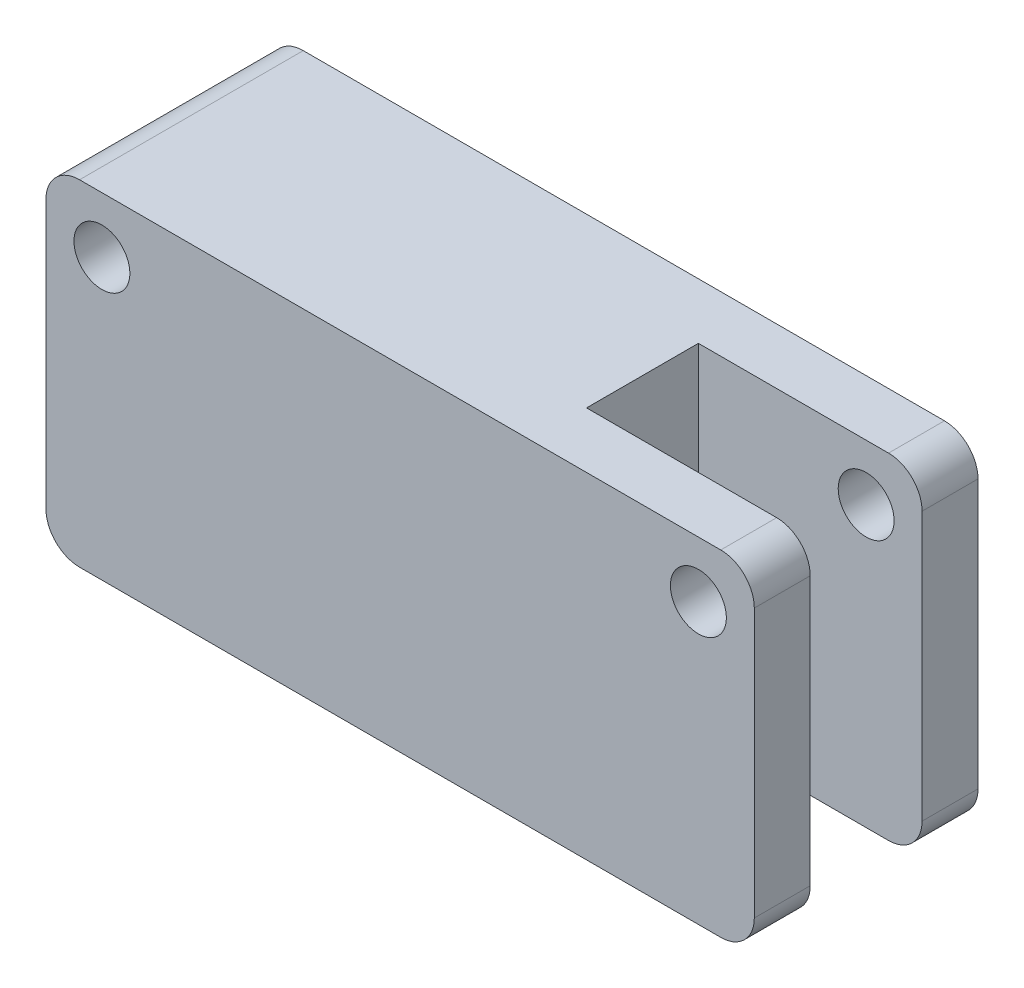
ISO-10303-21;
HEADER;
FILE_DESCRIPTION(('STEP AP214'),'2;1');
FILE_NAME('part.step','',(''),(''),'','','');
FILE_SCHEMA(('AUTOMOTIVE_DESIGN { 1 0 10303 214 1 1 1 1 }'));
ENDSEC;
DATA;
#1=APPLICATION_CONTEXT('core data for automotive mechanical design processes');
#2=APPLICATION_PROTOCOL_DEFINITION('international standard','automotive_design',2000,#1);
#3=PRODUCT_CONTEXT('',#1,'mechanical');
#4=PRODUCT('Part','Part','',(#3));
#5=PRODUCT_RELATED_PRODUCT_CATEGORY('part','',(#4));
#6=PRODUCT_DEFINITION_FORMATION('','',#4);
#7=PRODUCT_DEFINITION_CONTEXT('part definition',#1,'design');
#8=PRODUCT_DEFINITION('design','',#6,#7);
#9=PRODUCT_DEFINITION_SHAPE('','',#8);
#10=(LENGTH_UNIT() NAMED_UNIT(*) SI_UNIT(.MILLI.,.METRE.));
#11=(NAMED_UNIT(*) PLANE_ANGLE_UNIT() SI_UNIT($,.RADIAN.));
#12=(NAMED_UNIT(*) SI_UNIT($,.STERADIAN.) SOLID_ANGLE_UNIT());
#13=UNCERTAINTY_MEASURE_WITH_UNIT(LENGTH_MEASURE(1.E-05),#10,'distance_accuracy_value','');
#14=(GEOMETRIC_REPRESENTATION_CONTEXT(3) GLOBAL_UNCERTAINTY_ASSIGNED_CONTEXT((#13)) GLOBAL_UNIT_ASSIGNED_CONTEXT((#10,
#11,#12)) REPRESENTATION_CONTEXT('',''));
#15=CARTESIAN_POINT('',(0.,0.,0.));
#16=DIRECTION('',(0.,0.,1.));
#17=DIRECTION('',(1.,0.,0.));
#18=AXIS2_PLACEMENT_3D('',#15,#16,#17);
#19=CARTESIAN_POINT('',(63.33,15.,10.));
#20=DIRECTION('',(-1.,0.,0.));
#21=DIRECTION('',(0.,0.,1.));
#22=AXIS2_PLACEMENT_3D('',#19,#20,#21);
#23=PLANE('',#22);
#24=DIRECTION('',(0.,0.,-1.));
#25=VECTOR('',#24,1.);
#26=CARTESIAN_POINT('',(63.33,12.,10.));
#27=LINE('',#26,#25);
#28=CARTESIAN_POINT('',(63.33,12.,-10.));
#29=VERTEX_POINT('',#28);
#30=CARTESIAN_POINT('',(63.33,12.,-5.));
#31=VERTEX_POINT('',#30);
#32=EDGE_CURVE('E226',#29,#31,#27,.F.);
#33=ORIENTED_EDGE('',*,*,#32,.T.);
#34=DIRECTION('',(0.,1.,0.));
#35=VECTOR('',#34,1.);
#36=CARTESIAN_POINT('',(63.33,-15.,-5.));
#37=LINE('',#36,#35);
#38=CARTESIAN_POINT('',(63.33,-12.,-5.));
#39=VERTEX_POINT('',#38);
#40=EDGE_CURVE('E174',#39,#31,#37,.T.);
#41=ORIENTED_EDGE('',*,*,#40,.F.);
#42=DIRECTION('',(0.,0.,-1.));
#43=VECTOR('',#42,1.);
#44=CARTESIAN_POINT('',(63.33,-12.,-10.));
#45=LINE('',#44,#43);
#46=CARTESIAN_POINT('',(63.33,-12.,-10.));
#47=VERTEX_POINT('',#46);
#48=EDGE_CURVE('E221',#39,#47,#45,.T.);
#49=ORIENTED_EDGE('',*,*,#48,.T.);
#50=DIRECTION('',(0.,-1.,0.));
#51=VECTOR('',#50,1.);
#52=CARTESIAN_POINT('',(63.33,15.,-10.));
#53=LINE('',#52,#51);
#54=EDGE_CURVE('E197',#29,#47,#53,.T.);
#55=ORIENTED_EDGE('',*,*,#54,.F.);
#56=EDGE_LOOP('',(#33,#41,#49,#55));
#57=FACE_BOUND('',#56,.T.);
#58=ADVANCED_FACE('F36',(#57),#23,.F.);
#59=CARTESIAN_POINT('',(60.33,12.,0.));
#60=DIRECTION('',(0.,0.,-1.));
#61=DIRECTION('',(-1.,0.,0.));
#62=AXIS2_PLACEMENT_3D('',#59,#60,#61);
#63=CYLINDRICAL_SURFACE('',#62,3.);
#64=CARTESIAN_POINT('',(60.33,12.,-5.));
#65=DIRECTION('',(0.,0.,-1.));
#66=DIRECTION('',(-1.,0.,0.));
#67=AXIS2_PLACEMENT_3D('',#64,#65,#66);
#68=CIRCLE('',#67,3.);
#69=CARTESIAN_POINT('',(60.33,15.,-5.));
#70=VERTEX_POINT('',#69);
#71=EDGE_CURVE('E180',#31,#70,#68,.F.);
#72=ORIENTED_EDGE('',*,*,#71,.F.);
#73=ORIENTED_EDGE('',*,*,#32,.F.);
#74=CARTESIAN_POINT('',(60.33,12.,-10.));
#75=DIRECTION('',(0.,0.,1.));
#76=DIRECTION('',(1.,0.,0.));
#77=AXIS2_PLACEMENT_3D('',#74,#75,#76);
#78=CIRCLE('',#77,3.);
#79=CARTESIAN_POINT('',(60.33,15.,-10.));
#80=VERTEX_POINT('',#79);
#81=EDGE_CURVE('E219',#80,#29,#78,.F.);
#82=ORIENTED_EDGE('',*,*,#81,.F.);
#83=DIRECTION('',(0.,0.,-1.));
#84=VECTOR('',#83,1.);
#85=CARTESIAN_POINT('',(60.33,15.,0.));
#86=LINE('',#85,#84);
#87=EDGE_CURVE('E209',#70,#80,#86,.T.);
#88=ORIENTED_EDGE('',*,*,#87,.F.);
#89=EDGE_LOOP('',(#72,#73,#82,#88));
#90=FACE_BOUND('',#89,.T.);
#91=ADVANCED_FACE('F290',(#90),#63,.T.);
#92=CARTESIAN_POINT('',(60.33,-12.,10.));
#93=DIRECTION('',(0.,0.,1.));
#94=DIRECTION('',(1.,0.,0.));
#95=AXIS2_PLACEMENT_3D('',#92,#93,#94);
#96=CYLINDRICAL_SURFACE('',#95,3.);
#97=CARTESIAN_POINT('',(60.33,-12.,-5.));
#98=DIRECTION('',(0.,0.,-1.));
#99=DIRECTION('',(-1.,0.,0.));
#100=AXIS2_PLACEMENT_3D('',#97,#98,#99);
#101=CIRCLE('',#100,3.);
#102=CARTESIAN_POINT('',(60.33,-15.,-5.));
#103=VERTEX_POINT('',#102);
#104=EDGE_CURVE('E11',#103,#39,#101,.F.);
#105=ORIENTED_EDGE('',*,*,#104,.F.);
#106=DIRECTION('',(0.,0.,-1.));
#107=VECTOR('',#106,1.);
#108=CARTESIAN_POINT('',(60.33,-15.,10.));
#109=LINE('',#108,#107);
#110=CARTESIAN_POINT('',(60.33,-15.,-10.));
#111=VERTEX_POINT('',#110);
#112=EDGE_CURVE('E162',#111,#103,#109,.F.);
#113=ORIENTED_EDGE('',*,*,#112,.F.);
#114=CARTESIAN_POINT('',(60.33,-12.,-10.));
#115=DIRECTION('',(0.,0.,1.));
#116=DIRECTION('',(1.,0.,0.));
#117=AXIS2_PLACEMENT_3D('',#114,#115,#116);
#118=CIRCLE('',#117,3.);
#119=EDGE_CURVE('E217',#47,#111,#118,.F.);
#120=ORIENTED_EDGE('',*,*,#119,.F.);
#121=ORIENTED_EDGE('',*,*,#48,.F.);
#122=EDGE_LOOP('',(#105,#113,#120,#121));
#123=FACE_BOUND('',#122,.T.);
#124=ADVANCED_FACE('F281',(#123),#96,.T.);
#125=CARTESIAN_POINT('',(0.,15.,10.));
#126=DIRECTION('',(1.,0.,0.));
#127=DIRECTION('',(0.,0.,-1.));
#128=AXIS2_PLACEMENT_3D('',#125,#126,#127);
#129=PLANE('',#128);
#130=DIRECTION('',(0.,-1.,0.));
#131=VECTOR('',#130,1.);
#132=CARTESIAN_POINT('',(0.,15.,-10.));
#133=LINE('',#132,#131);
#134=CARTESIAN_POINT('',(0.,12.,-10.));
#135=VERTEX_POINT('',#134);
#136=CARTESIAN_POINT('',(0.,-12.,-10.));
#137=VERTEX_POINT('',#136);
#138=EDGE_CURVE('E190',#135,#137,#133,.T.);
#139=ORIENTED_EDGE('',*,*,#138,.T.);
#140=DIRECTION('',(0.,0.,1.));
#141=VECTOR('',#140,1.);
#142=CARTESIAN_POINT('',(0.,-12.,10.));
#143=LINE('',#142,#141);
#144=CARTESIAN_POINT('',(0.,-12.,10.));
#145=VERTEX_POINT('',#144);
#146=EDGE_CURVE('E242',#137,#145,#143,.T.);
#147=ORIENTED_EDGE('',*,*,#146,.T.);
#148=DIRECTION('',(0.,-1.,0.));
#149=VECTOR('',#148,1.);
#150=CARTESIAN_POINT('',(0.,15.,10.));
#151=LINE('',#150,#149);
#152=CARTESIAN_POINT('',(0.,12.,10.));
#153=VERTEX_POINT('',#152);
#154=EDGE_CURVE('E203',#153,#145,#151,.T.);
#155=ORIENTED_EDGE('',*,*,#154,.F.);
#156=DIRECTION('',(0.,0.,1.));
#157=VECTOR('',#156,1.);
#158=CARTESIAN_POINT('',(0.,12.,10.));
#159=LINE('',#158,#157);
#160=EDGE_CURVE('E240',#153,#135,#159,.F.);
#161=ORIENTED_EDGE('',*,*,#160,.T.);
#162=EDGE_LOOP('',(#139,#147,#155,#161));
#163=FACE_BOUND('',#162,.T.);
#164=ADVANCED_FACE('F273',(#163),#129,.F.);
#165=CARTESIAN_POINT('',(0.,15.,10.));
#166=DIRECTION('',(0.,0.,-1.));
#167=DIRECTION('',(-1.,0.,0.));
#168=AXIS2_PLACEMENT_3D('',#165,#166,#167);
#169=PLANE('',#168);
#170=CARTESIAN_POINT('',(58.33,10.,10.));
#171=DIRECTION('',(0.,0.,-1.));
#172=DIRECTION('',(-1.,0.,0.));
#173=AXIS2_PLACEMENT_3D('',#170,#171,#172);
#174=CIRCLE('',#173,2.49999999999992);
#175=CARTESIAN_POINT('',(55.8300000000001,10.,10.));
#176=VERTEX_POINT('',#175);
#177=EDGE_CURVE('E415',#176,#176,#174,.T.);
#178=ORIENTED_EDGE('',*,*,#177,.T.);
#179=EDGE_LOOP('',(#178));
#180=FACE_BOUND('',#179,.T.);
#181=CARTESIAN_POINT('',(5.,10.,10.));
#182=DIRECTION('',(0.,0.,-1.));
#183=DIRECTION('',(1.,0.,0.));
#184=AXIS2_PLACEMENT_3D('',#181,#182,#183);
#185=CIRCLE('',#184,2.5);
#186=CARTESIAN_POINT('',(7.5,10.,10.));
#187=VERTEX_POINT('',#186);
#188=EDGE_CURVE('E422',#187,#187,#185,.T.);
#189=ORIENTED_EDGE('',*,*,#188,.T.);
#190=EDGE_LOOP('',(#189));
#191=FACE_BOUND('',#190,.T.);
#192=DIRECTION('',(0.,-1.,0.));
#193=VECTOR('',#192,1.);
#194=CARTESIAN_POINT('',(63.33,15.,10.));
#195=LINE('',#194,#193);
#196=CARTESIAN_POINT('',(63.33,12.,10.));
#197=VERTEX_POINT('',#196);
#198=CARTESIAN_POINT('',(63.33,-12.,10.));
#199=VERTEX_POINT('',#198);
#200=EDGE_CURVE('E200',#197,#199,#195,.T.);
#201=ORIENTED_EDGE('',*,*,#200,.F.);
#202=CARTESIAN_POINT('',(60.33,12.,10.));
#203=DIRECTION('',(0.,0.,-1.));
#204=DIRECTION('',(-1.,0.,0.));
#205=AXIS2_PLACEMENT_3D('',#202,#203,#204);
#206=CIRCLE('',#205,3.);
#207=CARTESIAN_POINT('',(60.33,15.,10.));
#208=VERTEX_POINT('',#207);
#209=EDGE_CURVE('E234',#197,#208,#206,.F.);
#210=ORIENTED_EDGE('',*,*,#209,.T.);
#211=DIRECTION('',(1.,0.,0.));
#212=VECTOR('',#211,1.);
#213=CARTESIAN_POINT('',(0.,15.,10.));
#214=LINE('',#213,#212);
#215=CARTESIAN_POINT('',(3.,15.,10.));
#216=VERTEX_POINT('',#215);
#217=EDGE_CURVE('E183',#216,#208,#214,.T.);
#218=ORIENTED_EDGE('',*,*,#217,.F.);
#219=CARTESIAN_POINT('',(3.,12.,10.));
#220=DIRECTION('',(0.,0.,-1.));
#221=DIRECTION('',(-1.,0.,0.));
#222=AXIS2_PLACEMENT_3D('',#219,#220,#221);
#223=CIRCLE('',#222,3.);
#224=EDGE_CURVE('E229',#216,#153,#223,.F.);
#225=ORIENTED_EDGE('',*,*,#224,.T.);
#226=ORIENTED_EDGE('',*,*,#154,.T.);
#227=CARTESIAN_POINT('',(3.,-12.,10.));
#228=DIRECTION('',(0.,0.,-1.));
#229=DIRECTION('',(-1.,0.,0.));
#230=AXIS2_PLACEMENT_3D('',#227,#228,#229);
#231=CIRCLE('',#230,3.);
#232=CARTESIAN_POINT('',(3.,-15.,10.));
#233=VERTEX_POINT('',#232);
#234=EDGE_CURVE('E60',#145,#233,#231,.F.);
#235=ORIENTED_EDGE('',*,*,#234,.T.);
#236=DIRECTION('',(1.,0.,0.));
#237=VECTOR('',#236,1.);
#238=CARTESIAN_POINT('',(0.,-15.,10.));
#239=LINE('',#238,#237);
#240=CARTESIAN_POINT('',(60.33,-15.,10.));
#241=VERTEX_POINT('',#240);
#242=EDGE_CURVE('E182',#233,#241,#239,.T.);
#243=ORIENTED_EDGE('',*,*,#242,.T.);
#244=CARTESIAN_POINT('',(60.33,-12.,10.));
#245=DIRECTION('',(0.,0.,-1.));
#246=DIRECTION('',(-1.,0.,0.));
#247=AXIS2_PLACEMENT_3D('',#244,#245,#246);
#248=CIRCLE('',#247,3.);
#249=EDGE_CURVE('E232',#241,#199,#248,.F.);
#250=ORIENTED_EDGE('',*,*,#249,.T.);
#251=EDGE_LOOP('',(#201,#210,#218,#225,#226,#235,#243,#250));
#252=FACE_BOUND('',#251,.T.);
#253=ADVANCED_FACE('F253',(#180,#191,#252),#169,.F.);
#254=CARTESIAN_POINT('',(63.33,-12.,5.));
#255=VERTEX_POINT('',#254);
#256=EDGE_CURVE('E222',#199,#255,#45,.T.);
#257=ORIENTED_EDGE('',*,*,#256,.T.);
#258=DIRECTION('',(0.,1.,0.));
#259=VECTOR('',#258,1.);
#260=CARTESIAN_POINT('',(63.33,-15.,5.));
#261=LINE('',#260,#259);
#262=CARTESIAN_POINT('',(63.33,12.,5.));
#263=VERTEX_POINT('',#262);
#264=EDGE_CURVE('E52',#255,#263,#261,.T.);
#265=ORIENTED_EDGE('',*,*,#264,.T.);
#266=EDGE_CURVE('E225',#263,#197,#27,.F.);
#267=ORIENTED_EDGE('',*,*,#266,.T.);
#268=ORIENTED_EDGE('',*,*,#200,.T.);
#269=EDGE_LOOP('',(#257,#265,#267,#268));
#270=FACE_BOUND('',#269,.T.);
#271=ADVANCED_FACE('F256',(#270),#23,.F.);
#272=CARTESIAN_POINT('',(0.,15.,-10.));
#273=DIRECTION('',(0.,0.,1.));
#274=DIRECTION('',(1.,0.,0.));
#275=AXIS2_PLACEMENT_3D('',#272,#273,#274);
#276=PLANE('',#275);
#277=CARTESIAN_POINT('',(58.33,10.,-10.));
#278=DIRECTION('',(0.,0.,-1.));
#279=DIRECTION('',(-1.,0.,0.));
#280=AXIS2_PLACEMENT_3D('',#277,#278,#279);
#281=CIRCLE('',#280,2.49999999999992);
#282=CARTESIAN_POINT('',(55.8300000000001,10.,-10.));
#283=VERTEX_POINT('',#282);
#284=EDGE_CURVE('E418',#283,#283,#281,.T.);
#285=ORIENTED_EDGE('',*,*,#284,.F.);
#286=EDGE_LOOP('',(#285));
#287=FACE_BOUND('',#286,.T.);
#288=CARTESIAN_POINT('',(5.,10.,-10.));
#289=DIRECTION('',(0.,0.,-1.));
#290=DIRECTION('',(1.,0.,0.));
#291=AXIS2_PLACEMENT_3D('',#288,#289,#290);
#292=CIRCLE('',#291,2.5);
#293=CARTESIAN_POINT('',(7.5,10.,-10.));
#294=VERTEX_POINT('',#293);
#295=EDGE_CURVE('E426',#294,#294,#292,.T.);
#296=ORIENTED_EDGE('',*,*,#295,.F.);
#297=EDGE_LOOP('',(#296));
#298=FACE_BOUND('',#297,.T.);
#299=DIRECTION('',(-1.,0.,0.));
#300=VECTOR('',#299,1.);
#301=CARTESIAN_POINT('',(0.,15.,-10.));
#302=LINE('',#301,#300);
#303=CARTESIAN_POINT('',(3.,15.,-10.));
#304=VERTEX_POINT('',#303);
#305=EDGE_CURVE('E186',#80,#304,#302,.T.);
#306=ORIENTED_EDGE('',*,*,#305,.F.);
#307=ORIENTED_EDGE('',*,*,#81,.T.);
#308=ORIENTED_EDGE('',*,*,#54,.T.);
#309=ORIENTED_EDGE('',*,*,#119,.T.);
#310=DIRECTION('',(-1.,0.,0.));
#311=VECTOR('',#310,1.);
#312=CARTESIAN_POINT('',(0.,-15.,-10.));
#313=LINE('',#312,#311);
#314=CARTESIAN_POINT('',(3.,-15.,-10.));
#315=VERTEX_POINT('',#314);
#316=EDGE_CURVE('E187',#111,#315,#313,.T.);
#317=ORIENTED_EDGE('',*,*,#316,.T.);
#318=CARTESIAN_POINT('',(3.,-12.,-10.));
#319=DIRECTION('',(0.,0.,1.));
#320=DIRECTION('',(1.,0.,0.));
#321=AXIS2_PLACEMENT_3D('',#318,#319,#320);
#322=CIRCLE('',#321,3.);
#323=EDGE_CURVE('E215',#315,#137,#322,.F.);
#324=ORIENTED_EDGE('',*,*,#323,.T.);
#325=ORIENTED_EDGE('',*,*,#138,.F.);
#326=CARTESIAN_POINT('',(3.,12.,-10.));
#327=DIRECTION('',(0.,0.,1.));
#328=DIRECTION('',(1.,0.,0.));
#329=AXIS2_PLACEMENT_3D('',#326,#327,#328);
#330=CIRCLE('',#329,3.);
#331=EDGE_CURVE('E213',#135,#304,#330,.F.);
#332=ORIENTED_EDGE('',*,*,#331,.T.);
#333=EDGE_LOOP('',(#306,#307,#308,#309,#317,#324,#325,#332));
#334=FACE_BOUND('',#333,.T.);
#335=ADVANCED_FACE('F278',(#287,#298,#334),#276,.F.);
#336=CARTESIAN_POINT('',(0.,15.,0.));
#337=DIRECTION('',(0.,-1.,0.));
#338=DIRECTION('',(0.,0.,-1.));
#339=AXIS2_PLACEMENT_3D('',#336,#337,#338);
#340=PLANE('',#339);
#341=DIRECTION('',(0.,0.,1.));
#342=VECTOR('',#341,1.);
#343=CARTESIAN_POINT('',(43.33,15.,5.));
#344=LINE('',#343,#342);
#345=CARTESIAN_POINT('',(43.33,15.,-5.));
#346=VERTEX_POINT('',#345);
#347=CARTESIAN_POINT('',(43.33,15.,5.));
#348=VERTEX_POINT('',#347);
#349=EDGE_CURVE('E165',#346,#348,#344,.T.);
#350=ORIENTED_EDGE('',*,*,#349,.F.);
#351=DIRECTION('',(-1.,0.,0.));
#352=VECTOR('',#351,1.);
#353=CARTESIAN_POINT('',(43.33,15.,-5.));
#354=LINE('',#353,#352);
#355=EDGE_CURVE('E144',#70,#346,#354,.T.);
#356=ORIENTED_EDGE('',*,*,#355,.F.);
#357=ORIENTED_EDGE('',*,*,#87,.T.);
#358=ORIENTED_EDGE('',*,*,#305,.T.);
#359=DIRECTION('',(0.,0.,1.));
#360=VECTOR('',#359,1.);
#361=CARTESIAN_POINT('',(3.,15.,0.));
#362=LINE('',#361,#360);
#363=EDGE_CURVE('E206',#304,#216,#362,.T.);
#364=ORIENTED_EDGE('',*,*,#363,.T.);
#365=ORIENTED_EDGE('',*,*,#217,.T.);
#366=CARTESIAN_POINT('',(60.33,15.,5.));
#367=VERTEX_POINT('',#366);
#368=EDGE_CURVE('E210',#208,#367,#86,.T.);
#369=ORIENTED_EDGE('',*,*,#368,.T.);
#370=DIRECTION('',(1.,0.,0.));
#371=VECTOR('',#370,1.);
#372=CARTESIAN_POINT('',(63.33,15.,5.));
#373=LINE('',#372,#371);
#374=EDGE_CURVE('E163',#348,#367,#373,.T.);
#375=ORIENTED_EDGE('',*,*,#374,.F.);
#376=EDGE_LOOP('',(#350,#356,#357,#358,#364,#365,#369,#375));
#377=FACE_BOUND('',#376,.T.);
#378=ADVANCED_FACE('F264',(#377),#340,.F.);
#379=CARTESIAN_POINT('',(0.,-15.,0.));
#380=DIRECTION('',(0.,-1.,0.));
#381=DIRECTION('',(0.,0.,-1.));
#382=AXIS2_PLACEMENT_3D('',#379,#380,#381);
#383=PLANE('',#382);
#384=DIRECTION('',(-1.,0.,0.));
#385=VECTOR('',#384,1.);
#386=CARTESIAN_POINT('',(43.33,-15.,-5.));
#387=LINE('',#386,#385);
#388=CARTESIAN_POINT('',(43.33,-15.,-5.));
#389=VERTEX_POINT('',#388);
#390=EDGE_CURVE('E141',#103,#389,#387,.T.);
#391=ORIENTED_EDGE('',*,*,#390,.T.);
#392=DIRECTION('',(0.,0.,1.));
#393=VECTOR('',#392,1.);
#394=CARTESIAN_POINT('',(43.33,-15.,5.));
#395=LINE('',#394,#393);
#396=CARTESIAN_POINT('',(43.33,-15.,5.));
#397=VERTEX_POINT('',#396);
#398=EDGE_CURVE('E152',#389,#397,#395,.T.);
#399=ORIENTED_EDGE('',*,*,#398,.T.);
#400=DIRECTION('',(1.,0.,0.));
#401=VECTOR('',#400,1.);
#402=CARTESIAN_POINT('',(63.33,-15.,5.));
#403=LINE('',#402,#401);
#404=CARTESIAN_POINT('',(60.33,-15.,5.));
#405=VERTEX_POINT('',#404);
#406=EDGE_CURVE('E149',#397,#405,#403,.T.);
#407=ORIENTED_EDGE('',*,*,#406,.T.);
#408=EDGE_CURVE('E238',#405,#241,#109,.F.);
#409=ORIENTED_EDGE('',*,*,#408,.T.);
#410=ORIENTED_EDGE('',*,*,#242,.F.);
#411=DIRECTION('',(0.,0.,1.));
#412=VECTOR('',#411,1.);
#413=CARTESIAN_POINT('',(3.,-15.,-10.));
#414=LINE('',#413,#412);
#415=EDGE_CURVE('E236',#233,#315,#414,.F.);
#416=ORIENTED_EDGE('',*,*,#415,.T.);
#417=ORIENTED_EDGE('',*,*,#316,.F.);
#418=ORIENTED_EDGE('',*,*,#112,.T.);
#419=EDGE_LOOP('',(#391,#399,#407,#409,#410,#416,#417,#418));
#420=FACE_BOUND('',#419,.T.);
#421=ADVANCED_FACE('F159',(#420),#383,.T.);
#422=CARTESIAN_POINT('',(60.33,12.,5.));
#423=DIRECTION('',(0.,0.,1.));
#424=DIRECTION('',(1.,0.,0.));
#425=AXIS2_PLACEMENT_3D('',#422,#423,#424);
#426=CIRCLE('',#425,3.);
#427=EDGE_CURVE('E176',#367,#263,#426,.F.);
#428=ORIENTED_EDGE('',*,*,#427,.F.);
#429=ORIENTED_EDGE('',*,*,#368,.F.);
#430=ORIENTED_EDGE('',*,*,#209,.F.);
#431=ORIENTED_EDGE('',*,*,#266,.F.);
#432=EDGE_LOOP('',(#428,#429,#430,#431));
#433=FACE_BOUND('',#432,.T.);
#434=ADVANCED_FACE('F260',(#433),#63,.T.);
#435=CARTESIAN_POINT('',(60.33,-12.,5.));
#436=DIRECTION('',(0.,0.,1.));
#437=DIRECTION('',(1.,0.,0.));
#438=AXIS2_PLACEMENT_3D('',#435,#436,#437);
#439=CIRCLE('',#438,3.);
#440=EDGE_CURVE('E45',#255,#405,#439,.F.);
#441=ORIENTED_EDGE('',*,*,#440,.F.);
#442=ORIENTED_EDGE('',*,*,#256,.F.);
#443=ORIENTED_EDGE('',*,*,#249,.F.);
#444=ORIENTED_EDGE('',*,*,#408,.F.);
#445=EDGE_LOOP('',(#441,#442,#443,#444));
#446=FACE_BOUND('',#445,.T.);
#447=ADVANCED_FACE('F250',(#446),#96,.T.);
#448=CARTESIAN_POINT('',(3.,-12.,10.));
#449=DIRECTION('',(0.,0.,-1.));
#450=DIRECTION('',(-1.,0.,0.));
#451=AXIS2_PLACEMENT_3D('',#448,#449,#450);
#452=CYLINDRICAL_SURFACE('',#451,3.);
#453=ORIENTED_EDGE('',*,*,#323,.F.);
#454=ORIENTED_EDGE('',*,*,#415,.F.);
#455=ORIENTED_EDGE('',*,*,#234,.F.);
#456=ORIENTED_EDGE('',*,*,#146,.F.);
#457=EDGE_LOOP('',(#453,#454,#455,#456));
#458=FACE_BOUND('',#457,.T.);
#459=ADVANCED_FACE('F276',(#458),#452,.T.);
#460=CARTESIAN_POINT('',(3.,12.,0.));
#461=DIRECTION('',(0.,0.,1.));
#462=DIRECTION('',(1.,0.,0.));
#463=AXIS2_PLACEMENT_3D('',#460,#461,#462);
#464=CYLINDRICAL_SURFACE('',#463,3.);
#465=ORIENTED_EDGE('',*,*,#331,.F.);
#466=ORIENTED_EDGE('',*,*,#160,.F.);
#467=ORIENTED_EDGE('',*,*,#224,.F.);
#468=ORIENTED_EDGE('',*,*,#363,.F.);
#469=EDGE_LOOP('',(#465,#466,#467,#468));
#470=FACE_BOUND('',#469,.T.);
#471=ADVANCED_FACE('F38',(#470),#464,.T.);
#472=CARTESIAN_POINT('',(43.33,-15.,-5.));
#473=DIRECTION('',(0.,0.,-1.));
#474=DIRECTION('',(-1.,0.,0.));
#475=AXIS2_PLACEMENT_3D('',#472,#473,#474);
#476=PLANE('',#475);
#477=CARTESIAN_POINT('',(58.33,10.,-5.));
#478=DIRECTION('',(0.,0.,-1.));
#479=DIRECTION('',(-1.,0.,0.));
#480=AXIS2_PLACEMENT_3D('',#477,#478,#479);
#481=CIRCLE('',#480,2.49999999999992);
#482=CARTESIAN_POINT('',(55.8300000000001,10.,-5.));
#483=VERTEX_POINT('',#482);
#484=EDGE_CURVE('E168',#483,#483,#481,.T.);
#485=ORIENTED_EDGE('',*,*,#484,.T.);
#486=EDGE_LOOP('',(#485));
#487=FACE_BOUND('',#486,.T.);
#488=ORIENTED_EDGE('',*,*,#71,.T.);
#489=ORIENTED_EDGE('',*,*,#355,.T.);
#490=DIRECTION('',(0.,1.,0.));
#491=VECTOR('',#490,1.);
#492=CARTESIAN_POINT('',(43.33,-15.,-5.));
#493=LINE('',#492,#491);
#494=EDGE_CURVE('E137',#389,#346,#493,.T.);
#495=ORIENTED_EDGE('',*,*,#494,.F.);
#496=ORIENTED_EDGE('',*,*,#390,.F.);
#497=ORIENTED_EDGE('',*,*,#104,.T.);
#498=ORIENTED_EDGE('',*,*,#40,.T.);
#499=EDGE_LOOP('',(#488,#489,#495,#496,#497,#498));
#500=FACE_BOUND('',#499,.T.);
#501=ADVANCED_FACE('F139',(#487,#500),#476,.F.);
#502=CARTESIAN_POINT('',(63.33,-15.,5.));
#503=DIRECTION('',(0.,0.,1.));
#504=DIRECTION('',(1.,0.,0.));
#505=AXIS2_PLACEMENT_3D('',#502,#503,#504);
#506=PLANE('',#505);
#507=CARTESIAN_POINT('',(58.33,10.,5.));
#508=DIRECTION('',(0.,0.,1.));
#509=DIRECTION('',(1.,0.,0.));
#510=AXIS2_PLACEMENT_3D('',#507,#508,#509);
#511=CIRCLE('',#510,2.49999999999992);
#512=CARTESIAN_POINT('',(60.8299999999999,10.,5.));
#513=VERTEX_POINT('',#512);
#514=EDGE_CURVE('E40',#513,#513,#511,.T.);
#515=ORIENTED_EDGE('',*,*,#514,.T.);
#516=EDGE_LOOP('',(#515));
#517=FACE_BOUND('',#516,.T.);
#518=ORIENTED_EDGE('',*,*,#427,.T.);
#519=ORIENTED_EDGE('',*,*,#264,.F.);
#520=ORIENTED_EDGE('',*,*,#440,.T.);
#521=ORIENTED_EDGE('',*,*,#406,.F.);
#522=DIRECTION('',(0.,1.,0.));
#523=VECTOR('',#522,1.);
#524=CARTESIAN_POINT('',(43.33,-15.,5.));
#525=LINE('',#524,#523);
#526=EDGE_CURVE('E148',#397,#348,#525,.T.);
#527=ORIENTED_EDGE('',*,*,#526,.T.);
#528=ORIENTED_EDGE('',*,*,#374,.T.);
#529=EDGE_LOOP('',(#518,#519,#520,#521,#527,#528));
#530=FACE_BOUND('',#529,.T.);
#531=ADVANCED_FACE('F244',(#517,#530),#506,.F.);
#532=CARTESIAN_POINT('',(43.33,-15.,5.));
#533=DIRECTION('',(-1.,0.,0.));
#534=DIRECTION('',(0.,0.,1.));
#535=AXIS2_PLACEMENT_3D('',#532,#533,#534);
#536=PLANE('',#535);
#537=ORIENTED_EDGE('',*,*,#349,.T.);
#538=ORIENTED_EDGE('',*,*,#526,.F.);
#539=ORIENTED_EDGE('',*,*,#398,.F.);
#540=ORIENTED_EDGE('',*,*,#494,.T.);
#541=EDGE_LOOP('',(#537,#538,#539,#540));
#542=FACE_BOUND('',#541,.T.);
#543=ADVANCED_FACE('F153',(#542),#536,.F.);
#544=CARTESIAN_POINT('',(58.33,10.,10.));
#545=DIRECTION('',(0.,0.,-1.));
#546=DIRECTION('',(-1.,0.,0.));
#547=AXIS2_PLACEMENT_3D('',#544,#545,#546);
#548=CYLINDRICAL_SURFACE('',#547,2.49999999999992);
#549=ORIENTED_EDGE('',*,*,#177,.F.);
#550=EDGE_LOOP('',(#549));
#551=FACE_BOUND('',#550,.T.);
#552=ORIENTED_EDGE('',*,*,#514,.F.);
#553=EDGE_LOOP('',(#552));
#554=FACE_BOUND('',#553,.T.);
#555=ADVANCED_FACE('F366',(#551,#554),#548,.F.);
#556=ORIENTED_EDGE('',*,*,#284,.T.);
#557=EDGE_LOOP('',(#556));
#558=FACE_BOUND('',#557,.T.);
#559=ORIENTED_EDGE('',*,*,#484,.F.);
#560=EDGE_LOOP('',(#559));
#561=FACE_BOUND('',#560,.T.);
#562=ADVANCED_FACE('F381',(#558,#561),#548,.F.);
#563=CARTESIAN_POINT('',(5.,10.,10.));
#564=DIRECTION('',(0.,0.,-1.));
#565=DIRECTION('',(-1.,0.,0.));
#566=AXIS2_PLACEMENT_3D('',#563,#564,#565);
#567=CYLINDRICAL_SURFACE('',#566,2.5);
#568=ORIENTED_EDGE('',*,*,#188,.F.);
#569=EDGE_LOOP('',(#568));
#570=FACE_BOUND('',#569,.T.);
#571=ORIENTED_EDGE('',*,*,#295,.T.);
#572=EDGE_LOOP('',(#571));
#573=FACE_BOUND('',#572,.T.);
#574=ADVANCED_FACE('F388',(#570,#573),#567,.F.);
#575=CLOSED_SHELL('',(#58,#91,#124,#164,#253,#271,#335,#378,#421,#434,#447,#459,#471,#501,#531,
#543,#555,#562,#574));
#576=MANIFOLD_SOLID_BREP('B2',#575);
#577=ADVANCED_BREP_SHAPE_REPRESENTATION('',(#18,#576),#14);
#578=SHAPE_DEFINITION_REPRESENTATION(#9,#577);
ENDSEC;
END-ISO-10303-21;
